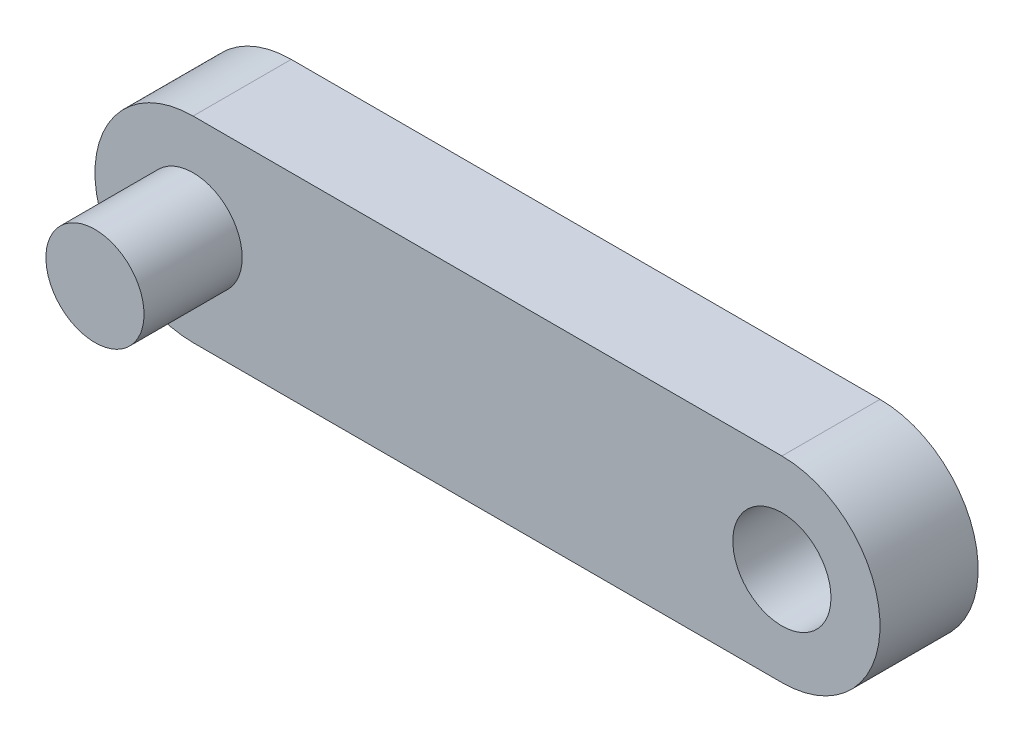
ISO-10303-21;
HEADER;
FILE_DESCRIPTION(('STEP AP214'),'2;1');
FILE_NAME('part.step','',(''),(''),'','','');
FILE_SCHEMA(('AUTOMOTIVE_DESIGN { 1 0 10303 214 1 1 1 1 }'));
ENDSEC;
DATA;
#1=APPLICATION_CONTEXT('core data for automotive mechanical design processes');
#2=APPLICATION_PROTOCOL_DEFINITION('international standard','automotive_design',2000,#1);
#3=PRODUCT_CONTEXT('',#1,'mechanical');
#4=PRODUCT('Part','Part','',(#3));
#5=PRODUCT_RELATED_PRODUCT_CATEGORY('part','',(#4));
#6=PRODUCT_DEFINITION_FORMATION('','',#4);
#7=PRODUCT_DEFINITION_CONTEXT('part definition',#1,'design');
#8=PRODUCT_DEFINITION('design','',#6,#7);
#9=PRODUCT_DEFINITION_SHAPE('','',#8);
#10=(LENGTH_UNIT() NAMED_UNIT(*) SI_UNIT(.MILLI.,.METRE.));
#11=(NAMED_UNIT(*) PLANE_ANGLE_UNIT() SI_UNIT($,.RADIAN.));
#12=(NAMED_UNIT(*) SI_UNIT($,.STERADIAN.) SOLID_ANGLE_UNIT());
#13=UNCERTAINTY_MEASURE_WITH_UNIT(LENGTH_MEASURE(1.E-05),#10,'distance_accuracy_value','');
#14=(GEOMETRIC_REPRESENTATION_CONTEXT(3) GLOBAL_UNCERTAINTY_ASSIGNED_CONTEXT((#13)) GLOBAL_UNIT_ASSIGNED_CONTEXT((#10,
#11,#12)) REPRESENTATION_CONTEXT('',''));
#15=CARTESIAN_POINT('',(0.,0.,0.));
#16=DIRECTION('',(0.,0.,1.));
#17=DIRECTION('',(1.,0.,0.));
#18=AXIS2_PLACEMENT_3D('',#15,#16,#17);
#19=CARTESIAN_POINT('',(-15.,0.,5.));
#20=DIRECTION('',(0.,0.,1.));
#21=DIRECTION('',(1.,0.,0.));
#22=AXIS2_PLACEMENT_3D('',#19,#20,#21);
#23=PLANE('',#22);
#24=CARTESIAN_POINT('',(-15.,0.,5.));
#25=DIRECTION('',(0.,0.,1.));
#26=DIRECTION('',(1.,0.,0.));
#27=AXIS2_PLACEMENT_3D('',#24,#25,#26);
#28=CIRCLE('',#27,2.5);
#29=CARTESIAN_POINT('',(-12.5,0.,5.));
#30=VERTEX_POINT('',#29);
#31=EDGE_CURVE('E100',#30,#30,#28,.T.);
#32=ORIENTED_EDGE('',*,*,#31,.F.);
#33=EDGE_LOOP('',(#32));
#34=FACE_BOUND('',#33,.T.);
#35=CARTESIAN_POINT('',(-15.,0.,5.));
#36=DIRECTION('',(0.,0.,1.));
#37=DIRECTION('',(1.,0.,0.));
#38=AXIS2_PLACEMENT_3D('',#35,#36,#37);
#39=CIRCLE('',#38,5.);
#40=CARTESIAN_POINT('',(-15.,5.,5.));
#41=VERTEX_POINT('',#40);
#42=CARTESIAN_POINT('',(-15.,-5.,5.));
#43=VERTEX_POINT('',#42);
#44=EDGE_CURVE('E85',#41,#43,#39,.T.);
#45=ORIENTED_EDGE('',*,*,#44,.T.);
#46=DIRECTION('',(1.,0.,0.));
#47=VECTOR('',#46,1.);
#48=CARTESIAN_POINT('',(-15.,-5.,5.));
#49=LINE('',#48,#47);
#50=CARTESIAN_POINT('',(15.,-4.99999999999999,5.));
#51=VERTEX_POINT('',#50);
#52=EDGE_CURVE('E80',#43,#51,#49,.T.);
#53=ORIENTED_EDGE('',*,*,#52,.T.);
#54=CARTESIAN_POINT('',(15.,0.,5.));
#55=DIRECTION('',(0.,0.,1.));
#56=DIRECTION('',(1.,0.,0.));
#57=AXIS2_PLACEMENT_3D('',#54,#55,#56);
#58=CIRCLE('',#57,5.);
#59=CARTESIAN_POINT('',(15.,5.00000000000001,5.));
#60=VERTEX_POINT('',#59);
#61=EDGE_CURVE('E83',#51,#60,#58,.T.);
#62=ORIENTED_EDGE('',*,*,#61,.T.);
#63=DIRECTION('',(-1.,0.,0.));
#64=VECTOR('',#63,1.);
#65=CARTESIAN_POINT('',(-15.,5.,5.));
#66=LINE('',#65,#64);
#67=EDGE_CURVE('E50',#60,#41,#66,.T.);
#68=ORIENTED_EDGE('',*,*,#67,.T.);
#69=EDGE_LOOP('',(#45,#53,#62,#68));
#70=FACE_BOUND('',#69,.T.);
#71=CARTESIAN_POINT('',(15.,0.,5.));
#72=DIRECTION('',(0.,0.,1.));
#73=DIRECTION('',(1.,0.,0.));
#74=AXIS2_PLACEMENT_3D('',#71,#72,#73);
#75=CIRCLE('',#74,2.5);
#76=CARTESIAN_POINT('',(17.5,0.,5.));
#77=VERTEX_POINT('',#76);
#78=EDGE_CURVE('E114',#77,#77,#75,.T.);
#79=ORIENTED_EDGE('',*,*,#78,.F.);
#80=EDGE_LOOP('',(#79));
#81=FACE_BOUND('',#80,.T.);
#82=ADVANCED_FACE('F33',(#34,#70,#81),#23,.T.);
#83=CARTESIAN_POINT('',(-15.,0.,0.));
#84=DIRECTION('',(0.,0.,1.));
#85=DIRECTION('',(1.,0.,0.));
#86=AXIS2_PLACEMENT_3D('',#83,#84,#85);
#87=PLANE('',#86);
#88=CARTESIAN_POINT('',(-15.,0.,0.));
#89=DIRECTION('',(0.,0.,1.));
#90=DIRECTION('',(1.,0.,0.));
#91=AXIS2_PLACEMENT_3D('',#88,#89,#90);
#92=CIRCLE('',#91,5.);
#93=CARTESIAN_POINT('',(-15.,5.,0.));
#94=VERTEX_POINT('',#93);
#95=CARTESIAN_POINT('',(-15.,-5.,0.));
#96=VERTEX_POINT('',#95);
#97=EDGE_CURVE('E97',#94,#96,#92,.T.);
#98=ORIENTED_EDGE('',*,*,#97,.F.);
#99=DIRECTION('',(-1.,0.,0.));
#100=VECTOR('',#99,1.);
#101=CARTESIAN_POINT('',(-15.,5.,0.));
#102=LINE('',#101,#100);
#103=CARTESIAN_POINT('',(15.,5.00000000000001,0.));
#104=VERTEX_POINT('',#103);
#105=EDGE_CURVE('E73',#104,#94,#102,.T.);
#106=ORIENTED_EDGE('',*,*,#105,.F.);
#107=CARTESIAN_POINT('',(15.,0.,0.));
#108=DIRECTION('',(0.,0.,1.));
#109=DIRECTION('',(1.,0.,0.));
#110=AXIS2_PLACEMENT_3D('',#107,#108,#109);
#111=CIRCLE('',#110,5.);
#112=CARTESIAN_POINT('',(15.,-4.99999999999999,0.));
#113=VERTEX_POINT('',#112);
#114=EDGE_CURVE('E67',#113,#104,#111,.T.);
#115=ORIENTED_EDGE('',*,*,#114,.F.);
#116=DIRECTION('',(1.,0.,0.));
#117=VECTOR('',#116,1.);
#118=CARTESIAN_POINT('',(-15.,-5.,0.));
#119=LINE('',#118,#117);
#120=EDGE_CURVE('E89',#96,#113,#119,.T.);
#121=ORIENTED_EDGE('',*,*,#120,.F.);
#122=EDGE_LOOP('',(#98,#106,#115,#121));
#123=FACE_BOUND('',#122,.T.);
#124=CARTESIAN_POINT('',(15.,0.,0.));
#125=DIRECTION('',(0.,0.,1.));
#126=DIRECTION('',(1.,0.,0.));
#127=AXIS2_PLACEMENT_3D('',#124,#125,#126);
#128=CIRCLE('',#127,2.5);
#129=CARTESIAN_POINT('',(17.5,0.,0.));
#130=VERTEX_POINT('',#129);
#131=EDGE_CURVE('E115',#130,#130,#128,.T.);
#132=ORIENTED_EDGE('',*,*,#131,.T.);
#133=EDGE_LOOP('',(#132));
#134=FACE_BOUND('',#133,.T.);
#135=ADVANCED_FACE('F108',(#123,#134),#87,.F.);
#136=CARTESIAN_POINT('',(-15.,0.,5.));
#137=DIRECTION('',(0.,0.,-1.));
#138=DIRECTION('',(-1.,0.,0.));
#139=AXIS2_PLACEMENT_3D('',#136,#137,#138);
#140=CYLINDRICAL_SURFACE('',#139,5.);
#141=ORIENTED_EDGE('',*,*,#97,.T.);
#142=DIRECTION('',(0.,0.,-1.));
#143=VECTOR('',#142,1.);
#144=CARTESIAN_POINT('',(-15.,-5.,5.));
#145=LINE('',#144,#143);
#146=EDGE_CURVE('E11',#43,#96,#145,.T.);
#147=ORIENTED_EDGE('',*,*,#146,.F.);
#148=ORIENTED_EDGE('',*,*,#44,.F.);
#149=DIRECTION('',(0.,0.,-1.));
#150=VECTOR('',#149,1.);
#151=CARTESIAN_POINT('',(-15.,5.,5.));
#152=LINE('',#151,#150);
#153=EDGE_CURVE('E93',#41,#94,#152,.T.);
#154=ORIENTED_EDGE('',*,*,#153,.T.);
#155=EDGE_LOOP('',(#141,#147,#148,#154));
#156=FACE_BOUND('',#155,.T.);
#157=ADVANCED_FACE('F35',(#156),#140,.T.);
#158=CARTESIAN_POINT('',(-15.,-5.,5.));
#159=DIRECTION('',(0.,1.,0.));
#160=DIRECTION('',(-1.,0.,0.));
#161=AXIS2_PLACEMENT_3D('',#158,#159,#160);
#162=PLANE('',#161);
#163=ORIENTED_EDGE('',*,*,#120,.T.);
#164=DIRECTION('',(0.,0.,-1.));
#165=VECTOR('',#164,1.);
#166=CARTESIAN_POINT('',(15.,-4.99999999999999,5.));
#167=LINE('',#166,#165);
#168=EDGE_CURVE('E42',#51,#113,#167,.T.);
#169=ORIENTED_EDGE('',*,*,#168,.F.);
#170=ORIENTED_EDGE('',*,*,#52,.F.);
#171=ORIENTED_EDGE('',*,*,#146,.T.);
#172=EDGE_LOOP('',(#163,#169,#170,#171));
#173=FACE_BOUND('',#172,.T.);
#174=ADVANCED_FACE('F88',(#173),#162,.F.);
#175=CARTESIAN_POINT('',(15.,0.,5.));
#176=DIRECTION('',(0.,0.,-1.));
#177=DIRECTION('',(-1.,0.,0.));
#178=AXIS2_PLACEMENT_3D('',#175,#176,#177);
#179=CYLINDRICAL_SURFACE('',#178,5.);
#180=ORIENTED_EDGE('',*,*,#114,.T.);
#181=DIRECTION('',(0.,0.,-1.));
#182=VECTOR('',#181,1.);
#183=CARTESIAN_POINT('',(15.,5.00000000000001,5.));
#184=LINE('',#183,#182);
#185=EDGE_CURVE('E90',#60,#104,#184,.T.);
#186=ORIENTED_EDGE('',*,*,#185,.F.);
#187=ORIENTED_EDGE('',*,*,#61,.F.);
#188=ORIENTED_EDGE('',*,*,#168,.T.);
#189=EDGE_LOOP('',(#180,#186,#187,#188));
#190=FACE_BOUND('',#189,.T.);
#191=ADVANCED_FACE('F91',(#190),#179,.T.);
#192=CARTESIAN_POINT('',(-15.,5.,5.));
#193=DIRECTION('',(0.,-1.,0.));
#194=DIRECTION('',(1.,0.,0.));
#195=AXIS2_PLACEMENT_3D('',#192,#193,#194);
#196=PLANE('',#195);
#197=ORIENTED_EDGE('',*,*,#105,.T.);
#198=ORIENTED_EDGE('',*,*,#153,.F.);
#199=ORIENTED_EDGE('',*,*,#67,.F.);
#200=ORIENTED_EDGE('',*,*,#185,.T.);
#201=EDGE_LOOP('',(#197,#198,#199,#200));
#202=FACE_BOUND('',#201,.T.);
#203=ADVANCED_FACE('F105',(#202),#196,.F.);
#204=CARTESIAN_POINT('',(15.,0.,5.));
#205=DIRECTION('',(0.,0.,-1.));
#206=DIRECTION('',(-1.,0.,0.));
#207=AXIS2_PLACEMENT_3D('',#204,#205,#206);
#208=CYLINDRICAL_SURFACE('',#207,2.5);
#209=ORIENTED_EDGE('',*,*,#78,.T.);
#210=EDGE_LOOP('',(#209));
#211=FACE_BOUND('',#210,.T.);
#212=ORIENTED_EDGE('',*,*,#131,.F.);
#213=EDGE_LOOP('',(#212));
#214=FACE_BOUND('',#213,.T.);
#215=ADVANCED_FACE('F128',(#211,#214),#208,.F.);
#216=CARTESIAN_POINT('',(-15.,0.,10.));
#217=DIRECTION('',(0.,0.,-1.));
#218=DIRECTION('',(-1.,0.,0.));
#219=AXIS2_PLACEMENT_3D('',#216,#217,#218);
#220=CYLINDRICAL_SURFACE('',#219,2.5);
#221=ORIENTED_EDGE('',*,*,#31,.T.);
#222=EDGE_LOOP('',(#221));
#223=FACE_BOUND('',#222,.T.);
#224=CARTESIAN_POINT('',(-15.,0.,10.));
#225=DIRECTION('',(0.,0.,1.));
#226=DIRECTION('',(1.,0.,0.));
#227=AXIS2_PLACEMENT_3D('',#224,#225,#226);
#228=CIRCLE('',#227,2.5);
#229=CARTESIAN_POINT('',(-12.5,0.,10.));
#230=VERTEX_POINT('',#229);
#231=EDGE_CURVE('E118',#230,#230,#228,.T.);
#232=ORIENTED_EDGE('',*,*,#231,.F.);
#233=EDGE_LOOP('',(#232));
#234=FACE_BOUND('',#233,.T.);
#235=ADVANCED_FACE('F126',(#223,#234),#220,.T.);
#236=CARTESIAN_POINT('',(0.,0.,10.));
#237=DIRECTION('',(0.,0.,1.));
#238=DIRECTION('',(1.,0.,0.));
#239=AXIS2_PLACEMENT_3D('',#236,#237,#238);
#240=PLANE('',#239);
#241=ORIENTED_EDGE('',*,*,#231,.T.);
#242=EDGE_LOOP('',(#241));
#243=FACE_BOUND('',#242,.T.);
#244=ADVANCED_FACE('F124',(#243),#240,.T.);
#245=CLOSED_SHELL('',(#82,#135,#157,#174,#191,#203,#215,#235,#244));
#246=MANIFOLD_SOLID_BREP('B2',#245);
#247=ADVANCED_BREP_SHAPE_REPRESENTATION('',(#18,#246),#14);
#248=SHAPE_DEFINITION_REPRESENTATION(#9,#247);
ENDSEC;
END-ISO-10303-21;
